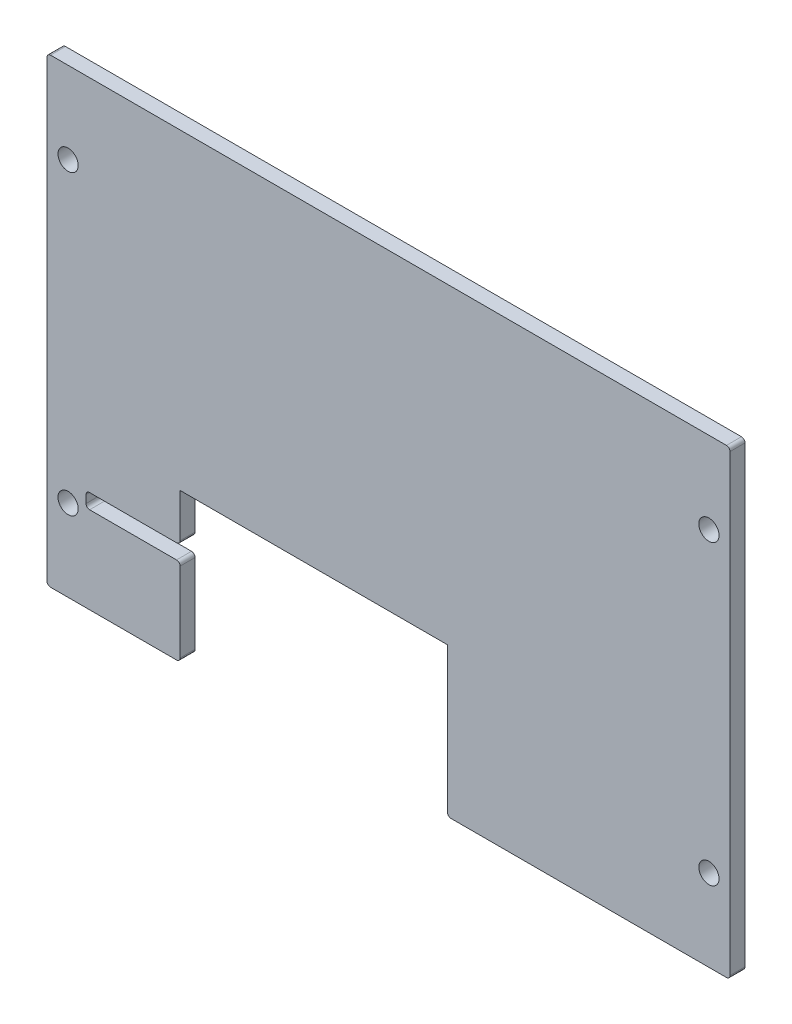
ISO-10303-21;
HEADER;
FILE_DESCRIPTION(('STEP AP214'),'2;1');
FILE_NAME('part.step','',(''),(''),'','','');
FILE_SCHEMA(('AUTOMOTIVE_DESIGN { 1 0 10303 214 1 1 1 1 }'));
ENDSEC;
DATA;
#1=APPLICATION_CONTEXT('core data for automotive mechanical design processes');
#2=APPLICATION_PROTOCOL_DEFINITION('international standard','automotive_design',2000,#1);
#3=PRODUCT_CONTEXT('',#1,'mechanical');
#4=PRODUCT('Part','Part','',(#3));
#5=PRODUCT_RELATED_PRODUCT_CATEGORY('part','',(#4));
#6=PRODUCT_DEFINITION_FORMATION('','',#4);
#7=PRODUCT_DEFINITION_CONTEXT('part definition',#1,'design');
#8=PRODUCT_DEFINITION('design','',#6,#7);
#9=PRODUCT_DEFINITION_SHAPE('','',#8);
#10=(LENGTH_UNIT() NAMED_UNIT(*) SI_UNIT(.MILLI.,.METRE.));
#11=(NAMED_UNIT(*) PLANE_ANGLE_UNIT() SI_UNIT($,.RADIAN.));
#12=(NAMED_UNIT(*) SI_UNIT($,.STERADIAN.) SOLID_ANGLE_UNIT());
#13=UNCERTAINTY_MEASURE_WITH_UNIT(LENGTH_MEASURE(1.E-05),#10,'distance_accuracy_value','');
#14=(GEOMETRIC_REPRESENTATION_CONTEXT(3) GLOBAL_UNCERTAINTY_ASSIGNED_CONTEXT((#13)) GLOBAL_UNIT_ASSIGNED_CONTEXT((#10,
#11,#12)) REPRESENTATION_CONTEXT('',''));
#15=CARTESIAN_POINT('',(0.,0.,0.));
#16=DIRECTION('',(0.,0.,1.));
#17=DIRECTION('',(1.,0.,0.));
#18=AXIS2_PLACEMENT_3D('',#15,#16,#17);
#19=CARTESIAN_POINT('',(28.43276,31.75,-65.3335481592298));
#20=DIRECTION('',(-1.,0.,0.));
#21=DIRECTION('',(0.,0.,1.));
#22=AXIS2_PLACEMENT_3D('',#19,#20,#21);
#23=PLANE('',#22);
#24=DIRECTION('',(0.,1.,0.));
#25=VECTOR('',#24,1.);
#26=CARTESIAN_POINT('',(28.43276,31.75,0.));
#27=LINE('',#26,#25);
#28=CARTESIAN_POINT('',(28.43276,0.761999999999999,0.));
#29=VERTEX_POINT('',#28);
#30=CARTESIAN_POINT('',(28.43276,17.74952,0.));
#31=VERTEX_POINT('',#30);
#32=EDGE_CURVE('E232',#29,#31,#27,.T.);
#33=ORIENTED_EDGE('',*,*,#32,.T.);
#34=DIRECTION('',(0.,0.,-1.));
#35=VECTOR('',#34,1.);
#36=CARTESIAN_POINT('',(28.43276,17.74952,-65.3335481592298));
#37=LINE('',#36,#35);
#38=CARTESIAN_POINT('',(28.43276,17.74952,3.2004));
#39=VERTEX_POINT('',#38);
#40=EDGE_CURVE('E273',#31,#39,#37,.F.);
#41=ORIENTED_EDGE('',*,*,#40,.T.);
#42=DIRECTION('',(0.,-1.,0.));
#43=VECTOR('',#42,1.);
#44=CARTESIAN_POINT('',(28.43276,31.75,3.2004));
#45=LINE('',#44,#43);
#46=CARTESIAN_POINT('',(28.43276,0.761999999999999,3.2004));
#47=VERTEX_POINT('',#46);
#48=EDGE_CURVE('E378',#39,#47,#45,.T.);
#49=ORIENTED_EDGE('',*,*,#48,.T.);
#50=DIRECTION('',(0.,0.,1.));
#51=VECTOR('',#50,1.);
#52=CARTESIAN_POINT('',(28.43276,0.761999999999999,-65.3335481592298));
#53=LINE('',#52,#51);
#54=EDGE_CURVE('E271',#47,#29,#53,.F.);
#55=ORIENTED_EDGE('',*,*,#54,.T.);
#56=EDGE_LOOP('',(#33,#41,#49,#55));
#57=FACE_BOUND('',#56,.T.);
#58=ADVANCED_FACE('F33',(#57),#23,.F.);
#59=CARTESIAN_POINT('',(0.,0.,3.2004));
#60=DIRECTION('',(0.,1.,0.));
#61=DIRECTION('',(0.,0.,1.));
#62=AXIS2_PLACEMENT_3D('',#59,#60,#61);
#63=PLANE('',#62);
#64=DIRECTION('',(1.,0.,0.));
#65=VECTOR('',#64,1.);
#66=CARTESIAN_POINT('',(0.,0.,0.));
#67=LINE('',#66,#65);
#68=CARTESIAN_POINT('',(0.762,0.,0.));
#69=VERTEX_POINT('',#68);
#70=CARTESIAN_POINT('',(27.67076,0.,0.));
#71=VERTEX_POINT('',#70);
#72=EDGE_CURVE('E235',#69,#71,#67,.T.);
#73=ORIENTED_EDGE('',*,*,#72,.T.);
#74=DIRECTION('',(0.,0.,1.));
#75=VECTOR('',#74,1.);
#76=CARTESIAN_POINT('',(27.67076,0.,3.2004));
#77=LINE('',#76,#75);
#78=CARTESIAN_POINT('',(27.67076,0.,3.2004));
#79=VERTEX_POINT('',#78);
#80=EDGE_CURVE('E305',#71,#79,#77,.T.);
#81=ORIENTED_EDGE('',*,*,#80,.T.);
#82=DIRECTION('',(1.,0.,0.));
#83=VECTOR('',#82,1.);
#84=CARTESIAN_POINT('',(0.,0.,3.2004));
#85=LINE('',#84,#83);
#86=CARTESIAN_POINT('',(0.762,0.,3.2004));
#87=VERTEX_POINT('',#86);
#88=EDGE_CURVE('E219',#87,#79,#85,.T.);
#89=ORIENTED_EDGE('',*,*,#88,.F.);
#90=DIRECTION('',(0.,0.,-1.));
#91=VECTOR('',#90,1.);
#92=CARTESIAN_POINT('',(0.762,0.,3.2004));
#93=LINE('',#92,#91);
#94=EDGE_CURVE('E302',#87,#69,#93,.T.);
#95=ORIENTED_EDGE('',*,*,#94,.T.);
#96=EDGE_LOOP('',(#73,#81,#89,#95));
#97=FACE_BOUND('',#96,.T.);
#98=ADVANCED_FACE('F395',(#97),#63,.F.);
#99=CARTESIAN_POINT('',(0.,98.425,3.2004));
#100=DIRECTION('',(1.,0.,0.));
#101=DIRECTION('',(0.,1.,0.));
#102=AXIS2_PLACEMENT_3D('',#99,#100,#101);
#103=PLANE('',#102);
#104=DIRECTION('',(0.,-1.,0.));
#105=VECTOR('',#104,1.);
#106=CARTESIAN_POINT('',(0.,98.425,0.));
#107=LINE('',#106,#105);
#108=CARTESIAN_POINT('',(0.,97.663,0.));
#109=VERTEX_POINT('',#108);
#110=CARTESIAN_POINT('',(0.,0.761999999999999,0.));
#111=VERTEX_POINT('',#110);
#112=EDGE_CURVE('E228',#109,#111,#107,.T.);
#113=ORIENTED_EDGE('',*,*,#112,.T.);
#114=DIRECTION('',(0.,0.,-1.));
#115=VECTOR('',#114,1.);
#116=CARTESIAN_POINT('',(0.,0.761999999999999,3.2004));
#117=LINE('',#116,#115);
#118=CARTESIAN_POINT('',(0.,0.761999999999999,3.2004));
#119=VERTEX_POINT('',#118);
#120=EDGE_CURVE('E310',#111,#119,#117,.F.);
#121=ORIENTED_EDGE('',*,*,#120,.T.);
#122=DIRECTION('',(0.,-1.,0.));
#123=VECTOR('',#122,1.);
#124=CARTESIAN_POINT('',(0.,98.425,3.2004));
#125=LINE('',#124,#123);
#126=CARTESIAN_POINT('',(0.,97.663,3.2004));
#127=VERTEX_POINT('',#126);
#128=EDGE_CURVE('E215',#127,#119,#125,.T.);
#129=ORIENTED_EDGE('',*,*,#128,.F.);
#130=DIRECTION('',(0.,0.,-1.));
#131=VECTOR('',#130,1.);
#132=CARTESIAN_POINT('',(0.,97.663,3.2004));
#133=LINE('',#132,#131);
#134=EDGE_CURVE('E307',#127,#109,#133,.T.);
#135=ORIENTED_EDGE('',*,*,#134,.T.);
#136=EDGE_LOOP('',(#113,#121,#129,#135));
#137=FACE_BOUND('',#136,.T.);
#138=ADVANCED_FACE('F402',(#137),#103,.F.);
#139=CARTESIAN_POINT('',(86.294760132,0.,0.));
#140=VERTEX_POINT('',#139);
#141=CARTESIAN_POINT('',(145.123353282042,0.,0.));
#142=VERTEX_POINT('',#141);
#143=EDGE_CURVE('E231',#140,#142,#67,.T.);
#144=ORIENTED_EDGE('',*,*,#143,.T.);
#145=DIRECTION('',(0.,0.,-1.));
#146=VECTOR('',#145,1.);
#147=CARTESIAN_POINT('',(145.123353282042,0.,3.2004));
#148=LINE('',#147,#146);
#149=CARTESIAN_POINT('',(145.123353282042,0.,3.2004));
#150=VERTEX_POINT('',#149);
#151=EDGE_CURVE('E299',#142,#150,#148,.F.);
#152=ORIENTED_EDGE('',*,*,#151,.T.);
#153=CARTESIAN_POINT('',(86.294760132,0.,3.2004));
#154=VERTEX_POINT('',#153);
#155=EDGE_CURVE('E217',#154,#150,#85,.T.);
#156=ORIENTED_EDGE('',*,*,#155,.F.);
#157=DIRECTION('',(0.,0.,1.));
#158=VECTOR('',#157,1.);
#159=CARTESIAN_POINT('',(86.294760132,0.,3.2004));
#160=LINE('',#159,#158);
#161=EDGE_CURVE('E297',#154,#140,#160,.F.);
#162=ORIENTED_EDGE('',*,*,#161,.T.);
#163=EDGE_LOOP('',(#144,#152,#156,#162));
#164=FACE_BOUND('',#163,.T.);
#165=ADVANCED_FACE('F429',(#164),#63,.F.);
#166=CARTESIAN_POINT('',(145.885353282042,98.425,3.2004));
#167=DIRECTION('',(-1.,0.,0.));
#168=DIRECTION('',(0.,0.,1.));
#169=AXIS2_PLACEMENT_3D('',#166,#167,#168);
#170=PLANE('',#169);
#171=DIRECTION('',(0.,1.,0.));
#172=VECTOR('',#171,1.);
#173=CARTESIAN_POINT('',(145.885353282042,98.425,3.2004));
#174=LINE('',#173,#172);
#175=CARTESIAN_POINT('',(145.885353282042,0.761999999999999,3.2004));
#176=VERTEX_POINT('',#175);
#177=CARTESIAN_POINT('',(145.885353282042,97.663,3.2004));
#178=VERTEX_POINT('',#177);
#179=EDGE_CURVE('E221',#176,#178,#174,.T.);
#180=ORIENTED_EDGE('',*,*,#179,.F.);
#181=DIRECTION('',(0.,0.,-1.));
#182=VECTOR('',#181,1.);
#183=CARTESIAN_POINT('',(145.885353282042,0.761999999999999,3.2004));
#184=LINE('',#183,#182);
#185=CARTESIAN_POINT('',(145.885353282042,0.761999999999999,0.));
#186=VERTEX_POINT('',#185);
#187=EDGE_CURVE('E294',#176,#186,#184,.T.);
#188=ORIENTED_EDGE('',*,*,#187,.T.);
#189=DIRECTION('',(0.,1.,0.));
#190=VECTOR('',#189,1.);
#191=CARTESIAN_POINT('',(145.885353282042,98.425,0.));
#192=LINE('',#191,#190);
#193=CARTESIAN_POINT('',(145.885353282042,97.663,0.));
#194=VERTEX_POINT('',#193);
#195=EDGE_CURVE('E236',#186,#194,#192,.T.);
#196=ORIENTED_EDGE('',*,*,#195,.T.);
#197=DIRECTION('',(0.,0.,-1.));
#198=VECTOR('',#197,1.);
#199=CARTESIAN_POINT('',(145.885353282042,97.663,3.2004));
#200=LINE('',#199,#198);
#201=EDGE_CURVE('E292',#194,#178,#200,.F.);
#202=ORIENTED_EDGE('',*,*,#201,.T.);
#203=EDGE_LOOP('',(#180,#188,#196,#202));
#204=FACE_BOUND('',#203,.T.);
#205=ADVANCED_FACE('F420',(#204),#170,.F.);
#206=CARTESIAN_POINT('',(0.,98.425,3.2004));
#207=DIRECTION('',(0.,-1.,0.));
#208=DIRECTION('',(0.,0.,-1.));
#209=AXIS2_PLACEMENT_3D('',#206,#207,#208);
#210=PLANE('',#209);
#211=DIRECTION('',(-1.,0.,0.));
#212=VECTOR('',#211,1.);
#213=CARTESIAN_POINT('',(0.,98.425,3.2004));
#214=LINE('',#213,#212);
#215=CARTESIAN_POINT('',(145.123353282042,98.425,3.2004));
#216=VERTEX_POINT('',#215);
#217=CARTESIAN_POINT('',(0.762,98.425,3.2004));
#218=VERTEX_POINT('',#217);
#219=EDGE_CURVE('E224',#216,#218,#214,.T.);
#220=ORIENTED_EDGE('',*,*,#219,.F.);
#221=DIRECTION('',(0.,0.,-1.));
#222=VECTOR('',#221,1.);
#223=CARTESIAN_POINT('',(145.123353282042,98.425,3.2004));
#224=LINE('',#223,#222);
#225=CARTESIAN_POINT('',(145.123353282042,98.425,0.));
#226=VERTEX_POINT('',#225);
#227=EDGE_CURVE('E314',#216,#226,#224,.T.);
#228=ORIENTED_EDGE('',*,*,#227,.T.);
#229=DIRECTION('',(-1.,0.,0.));
#230=VECTOR('',#229,1.);
#231=CARTESIAN_POINT('',(0.,98.425,0.));
#232=LINE('',#231,#230);
#233=CARTESIAN_POINT('',(0.762,98.425,0.));
#234=VERTEX_POINT('',#233);
#235=EDGE_CURVE('E218',#226,#234,#232,.T.);
#236=ORIENTED_EDGE('',*,*,#235,.T.);
#237=DIRECTION('',(0.,0.,-1.));
#238=VECTOR('',#237,1.);
#239=CARTESIAN_POINT('',(0.762,98.425,3.2004));
#240=LINE('',#239,#238);
#241=EDGE_CURVE('E312',#234,#218,#240,.F.);
#242=ORIENTED_EDGE('',*,*,#241,.T.);
#243=EDGE_LOOP('',(#220,#228,#236,#242));
#244=FACE_BOUND('',#243,.T.);
#245=ADVANCED_FACE('F411',(#244),#210,.F.);
#246=CARTESIAN_POINT('',(0.,0.,3.2004));
#247=DIRECTION('',(0.,0.,1.));
#248=DIRECTION('',(1.,0.,0.));
#249=AXIS2_PLACEMENT_3D('',#246,#247,#248);
#250=PLANE('',#249);
#251=ORIENTED_EDGE('',*,*,#48,.F.);
#252=CARTESIAN_POINT('',(27.67076,17.74952,3.2004));
#253=DIRECTION('',(0.,0.,1.));
#254=DIRECTION('',(1.,0.,0.));
#255=AXIS2_PLACEMENT_3D('',#252,#253,#254);
#256=CIRCLE('',#255,0.762);
#257=CARTESIAN_POINT('',(27.67076,18.51152,3.2004));
#258=VERTEX_POINT('',#257);
#259=EDGE_CURVE('E287',#39,#258,#256,.T.);
#260=ORIENTED_EDGE('',*,*,#259,.T.);
#261=DIRECTION('',(-1.,0.,0.));
#262=VECTOR('',#261,1.);
#263=CARTESIAN_POINT('',(28.43276,18.51152,3.2004));
#264=LINE('',#263,#262);
#265=CARTESIAN_POINT('',(9.1019099778454,18.51152,3.2004));
#266=VERTEX_POINT('',#265);
#267=EDGE_CURVE('E343',#258,#266,#264,.T.);
#268=ORIENTED_EDGE('',*,*,#267,.T.);
#269=CARTESIAN_POINT('',(9.10190997784539,19.27352,3.2004));
#270=DIRECTION('',(0.,0.,1.));
#271=DIRECTION('',(1.,0.,0.));
#272=AXIS2_PLACEMENT_3D('',#269,#270,#271);
#273=CIRCLE('',#272,0.762);
#274=CARTESIAN_POINT('',(8.33990997784539,19.27352,3.2004));
#275=VERTEX_POINT('',#274);
#276=EDGE_CURVE('E11',#266,#275,#273,.F.);
#277=ORIENTED_EDGE('',*,*,#276,.T.);
#278=DIRECTION('',(0.,1.,0.));
#279=VECTOR('',#278,1.);
#280=CARTESIAN_POINT('',(8.33990997784539,18.51152,3.2004));
#281=LINE('',#280,#279);
#282=CARTESIAN_POINT('',(8.33990997784539,20.92452,3.2004));
#283=VERTEX_POINT('',#282);
#284=EDGE_CURVE('E341',#275,#283,#281,.T.);
#285=ORIENTED_EDGE('',*,*,#284,.T.);
#286=CARTESIAN_POINT('',(9.1019099778454,20.92452,3.2004));
#287=DIRECTION('',(0.,0.,1.));
#288=DIRECTION('',(1.,0.,0.));
#289=AXIS2_PLACEMENT_3D('',#286,#287,#288);
#290=CIRCLE('',#289,0.762);
#291=CARTESIAN_POINT('',(9.1019099778454,21.68652,3.2004));
#292=VERTEX_POINT('',#291);
#293=EDGE_CURVE('E319',#283,#292,#290,.F.);
#294=ORIENTED_EDGE('',*,*,#293,.T.);
#295=DIRECTION('',(1.,0.,0.));
#296=VECTOR('',#295,1.);
#297=CARTESIAN_POINT('',(28.43276,21.68652,3.2004));
#298=LINE('',#297,#296);
#299=CARTESIAN_POINT('',(27.67076,21.68652,3.2004));
#300=VERTEX_POINT('',#299);
#301=EDGE_CURVE('E347',#292,#300,#298,.T.);
#302=ORIENTED_EDGE('',*,*,#301,.T.);
#303=CARTESIAN_POINT('',(27.67076,22.44852,3.20040000000001));
#304=DIRECTION('',(0.,0.,1.));
#305=DIRECTION('',(1.,0.,0.));
#306=AXIS2_PLACEMENT_3D('',#303,#304,#305);
#307=CIRCLE('',#306,0.762);
#308=CARTESIAN_POINT('',(28.43276,22.44852,3.2004));
#309=VERTEX_POINT('',#308);
#310=EDGE_CURVE('E285',#300,#309,#307,.T.);
#311=ORIENTED_EDGE('',*,*,#310,.T.);
#312=CARTESIAN_POINT('',(28.43276,31.75,3.2004));
#313=VERTEX_POINT('',#312);
#314=EDGE_CURVE('E194',#313,#309,#45,.T.);
#315=ORIENTED_EDGE('',*,*,#314,.F.);
#316=DIRECTION('',(-1.,0.,0.));
#317=VECTOR('',#316,1.);
#318=CARTESIAN_POINT('',(28.43276,31.75,3.2004));
#319=LINE('',#318,#317);
#320=CARTESIAN_POINT('',(85.532760132,31.75,3.2004));
#321=VERTEX_POINT('',#320);
#322=EDGE_CURVE('E193',#321,#313,#319,.T.);
#323=ORIENTED_EDGE('',*,*,#322,.F.);
#324=DIRECTION('',(0.,1.,0.));
#325=VECTOR('',#324,1.);
#326=CARTESIAN_POINT('',(85.532760132,31.75,3.2004));
#327=LINE('',#326,#325);
#328=CARTESIAN_POINT('',(85.532760132,0.761999999999999,3.2004));
#329=VERTEX_POINT('',#328);
#330=EDGE_CURVE('E184',#329,#321,#327,.T.);
#331=ORIENTED_EDGE('',*,*,#330,.F.);
#332=CARTESIAN_POINT('',(86.294760132,0.761999999999999,3.20040000000001));
#333=DIRECTION('',(0.,0.,1.));
#334=DIRECTION('',(1.,0.,0.));
#335=AXIS2_PLACEMENT_3D('',#332,#333,#334);
#336=CIRCLE('',#335,0.762);
#337=EDGE_CURVE('E281',#329,#154,#336,.T.);
#338=ORIENTED_EDGE('',*,*,#337,.T.);
#339=ORIENTED_EDGE('',*,*,#155,.T.);
#340=CARTESIAN_POINT('',(145.123353282042,0.761999999999999,3.2004));
#341=DIRECTION('',(0.,0.,1.));
#342=DIRECTION('',(1.,0.,0.));
#343=AXIS2_PLACEMENT_3D('',#340,#341,#342);
#344=CIRCLE('',#343,0.762);
#345=EDGE_CURVE('E283',#150,#176,#344,.T.);
#346=ORIENTED_EDGE('',*,*,#345,.T.);
#347=ORIENTED_EDGE('',*,*,#179,.T.);
#348=CARTESIAN_POINT('',(145.123353282042,97.663,3.2004));
#349=DIRECTION('',(0.,0.,1.));
#350=DIRECTION('',(1.,0.,0.));
#351=AXIS2_PLACEMENT_3D('',#348,#349,#350);
#352=CIRCLE('',#351,0.762);
#353=EDGE_CURVE('E277',#178,#216,#352,.T.);
#354=ORIENTED_EDGE('',*,*,#353,.T.);
#355=ORIENTED_EDGE('',*,*,#219,.T.);
#356=CARTESIAN_POINT('',(0.762,97.663,3.2004));
#357=DIRECTION('',(0.,0.,1.));
#358=DIRECTION('',(1.,0.,0.));
#359=AXIS2_PLACEMENT_3D('',#356,#357,#358);
#360=CIRCLE('',#359,0.762);
#361=EDGE_CURVE('E275',#218,#127,#360,.T.);
#362=ORIENTED_EDGE('',*,*,#361,.T.);
#363=ORIENTED_EDGE('',*,*,#128,.T.);
#364=CARTESIAN_POINT('',(0.762,0.762,3.2004));
#365=DIRECTION('',(0.,0.,1.));
#366=DIRECTION('',(1.,0.,0.));
#367=AXIS2_PLACEMENT_3D('',#364,#365,#366);
#368=CIRCLE('',#367,0.762);
#369=EDGE_CURVE('E56',#119,#87,#368,.T.);
#370=ORIENTED_EDGE('',*,*,#369,.T.);
#371=ORIENTED_EDGE('',*,*,#88,.T.);
#372=CARTESIAN_POINT('',(27.67076,0.762,3.2004));
#373=DIRECTION('',(0.,0.,1.));
#374=DIRECTION('',(1.,0.,0.));
#375=AXIS2_PLACEMENT_3D('',#372,#373,#374);
#376=CIRCLE('',#375,0.762);
#377=EDGE_CURVE('E48',#79,#47,#376,.T.);
#378=ORIENTED_EDGE('',*,*,#377,.T.);
#379=EDGE_LOOP('',(#251,#260,#268,#277,#285,#294,#302,#311,#315,#323,#331,#338,#339,#346,#347,
#354,#355,#362,#363,#370,#371,#378));
#380=FACE_BOUND('',#379,.T.);
#381=CARTESIAN_POINT('',(4.5085,80.9625,3.2004));
#382=DIRECTION('',(0.,0.,1.));
#383=DIRECTION('',(1.,0.,0.));
#384=AXIS2_PLACEMENT_3D('',#381,#382,#383);
#385=CIRCLE('',#384,2.159);
#386=CARTESIAN_POINT('',(6.6675,80.9625,3.2004));
#387=VERTEX_POINT('',#386);
#388=EDGE_CURVE('E350',#387,#387,#385,.T.);
#389=ORIENTED_EDGE('',*,*,#388,.F.);
#390=EDGE_LOOP('',(#389));
#391=FACE_BOUND('',#390,.T.);
#392=CARTESIAN_POINT('',(4.50850000000002,17.4625,3.2004));
#393=DIRECTION('',(0.,0.,1.));
#394=DIRECTION('',(1.,0.,0.));
#395=AXIS2_PLACEMENT_3D('',#392,#393,#394);
#396=CIRCLE('',#395,2.159);
#397=CARTESIAN_POINT('',(6.66750000000002,17.4625,3.2004));
#398=VERTEX_POINT('',#397);
#399=EDGE_CURVE('E363',#398,#398,#396,.T.);
#400=ORIENTED_EDGE('',*,*,#399,.F.);
#401=EDGE_LOOP('',(#400));
#402=FACE_BOUND('',#401,.T.);
#403=CARTESIAN_POINT('',(141.376853282042,17.4625,3.2004));
#404=DIRECTION('',(0.,0.,1.));
#405=DIRECTION('',(1.,0.,0.));
#406=AXIS2_PLACEMENT_3D('',#403,#404,#405);
#407=CIRCLE('',#406,2.15899999999999);
#408=CARTESIAN_POINT('',(143.535853282042,17.4625,3.2004));
#409=VERTEX_POINT('',#408);
#410=EDGE_CURVE('E355',#409,#409,#407,.T.);
#411=ORIENTED_EDGE('',*,*,#410,.F.);
#412=EDGE_LOOP('',(#411));
#413=FACE_BOUND('',#412,.T.);
#414=CARTESIAN_POINT('',(141.376853282042,80.9625,3.2004));
#415=DIRECTION('',(0.,0.,1.));
#416=DIRECTION('',(1.,0.,0.));
#417=AXIS2_PLACEMENT_3D('',#414,#415,#416);
#418=CIRCLE('',#417,2.15899999999999);
#419=CARTESIAN_POINT('',(143.535853282042,80.9625,3.2004));
#420=VERTEX_POINT('',#419);
#421=EDGE_CURVE('E362',#420,#420,#418,.T.);
#422=ORIENTED_EDGE('',*,*,#421,.F.);
#423=EDGE_LOOP('',(#422));
#424=FACE_BOUND('',#423,.T.);
#425=ADVANCED_FACE('F207',(#380,#391,#402,#413,#424),#250,.T.);
#426=CARTESIAN_POINT('',(0.,0.,0.));
#427=DIRECTION('',(0.,0.,1.));
#428=DIRECTION('',(1.,0.,0.));
#429=AXIS2_PLACEMENT_3D('',#426,#427,#428);
#430=PLANE('',#429);
#431=CARTESIAN_POINT('',(4.5085,80.9625,0.));
#432=DIRECTION('',(0.,0.,1.));
#433=DIRECTION('',(1.,0.,0.));
#434=AXIS2_PLACEMENT_3D('',#431,#432,#433);
#435=CIRCLE('',#434,2.159);
#436=CARTESIAN_POINT('',(6.6675,80.9625,0.));
#437=VERTEX_POINT('',#436);
#438=EDGE_CURVE('E366',#437,#437,#435,.F.);
#439=ORIENTED_EDGE('',*,*,#438,.F.);
#440=EDGE_LOOP('',(#439));
#441=FACE_BOUND('',#440,.T.);
#442=CARTESIAN_POINT('',(4.50850000000002,17.4625,0.));
#443=DIRECTION('',(0.,0.,1.));
#444=DIRECTION('',(1.,0.,0.));
#445=AXIS2_PLACEMENT_3D('',#442,#443,#444);
#446=CIRCLE('',#445,2.159);
#447=CARTESIAN_POINT('',(6.66750000000002,17.4625,0.));
#448=VERTEX_POINT('',#447);
#449=EDGE_CURVE('E359',#448,#448,#446,.F.);
#450=ORIENTED_EDGE('',*,*,#449,.F.);
#451=EDGE_LOOP('',(#450));
#452=FACE_BOUND('',#451,.T.);
#453=CARTESIAN_POINT('',(141.376853282042,17.4625,0.));
#454=DIRECTION('',(0.,0.,1.));
#455=DIRECTION('',(1.,0.,0.));
#456=AXIS2_PLACEMENT_3D('',#453,#454,#455);
#457=CIRCLE('',#456,2.15899999999999);
#458=CARTESIAN_POINT('',(143.535853282042,17.4625,0.));
#459=VERTEX_POINT('',#458);
#460=EDGE_CURVE('E358',#459,#459,#457,.F.);
#461=ORIENTED_EDGE('',*,*,#460,.F.);
#462=EDGE_LOOP('',(#461));
#463=FACE_BOUND('',#462,.T.);
#464=CARTESIAN_POINT('',(141.376853282042,80.9625,0.));
#465=DIRECTION('',(0.,0.,1.));
#466=DIRECTION('',(1.,0.,0.));
#467=AXIS2_PLACEMENT_3D('',#464,#465,#466);
#468=CIRCLE('',#467,2.15899999999999);
#469=CARTESIAN_POINT('',(143.535853282042,80.9625,0.));
#470=VERTEX_POINT('',#469);
#471=EDGE_CURVE('E375',#470,#470,#468,.F.);
#472=ORIENTED_EDGE('',*,*,#471,.F.);
#473=EDGE_LOOP('',(#472));
#474=FACE_BOUND('',#473,.T.);
#475=DIRECTION('',(-1.,0.,0.));
#476=VECTOR('',#475,1.);
#477=CARTESIAN_POINT('',(28.43276,18.51152,0.));
#478=LINE('',#477,#476);
#479=CARTESIAN_POINT('',(27.67076,18.51152,0.));
#480=VERTEX_POINT('',#479);
#481=CARTESIAN_POINT('',(9.1019099778454,18.51152,0.));
#482=VERTEX_POINT('',#481);
#483=EDGE_CURVE('E325',#480,#482,#478,.T.);
#484=ORIENTED_EDGE('',*,*,#483,.F.);
#485=CARTESIAN_POINT('',(27.67076,17.74952,0.));
#486=DIRECTION('',(0.,0.,1.));
#487=DIRECTION('',(1.,0.,0.));
#488=AXIS2_PLACEMENT_3D('',#485,#486,#487);
#489=CIRCLE('',#488,0.762);
#490=EDGE_CURVE('E269',#480,#31,#489,.F.);
#491=ORIENTED_EDGE('',*,*,#490,.T.);
#492=ORIENTED_EDGE('',*,*,#32,.F.);
#493=CARTESIAN_POINT('',(27.67076,0.762,0.));
#494=DIRECTION('',(0.,0.,1.));
#495=DIRECTION('',(1.,0.,0.));
#496=AXIS2_PLACEMENT_3D('',#493,#494,#495);
#497=CIRCLE('',#496,0.762);
#498=EDGE_CURVE('E261',#29,#71,#497,.F.);
#499=ORIENTED_EDGE('',*,*,#498,.T.);
#500=ORIENTED_EDGE('',*,*,#72,.F.);
#501=CARTESIAN_POINT('',(0.762,0.762,0.));
#502=DIRECTION('',(0.,0.,1.));
#503=DIRECTION('',(1.,0.,0.));
#504=AXIS2_PLACEMENT_3D('',#501,#502,#503);
#505=CIRCLE('',#504,0.762);
#506=EDGE_CURVE('E259',#69,#111,#505,.F.);
#507=ORIENTED_EDGE('',*,*,#506,.T.);
#508=ORIENTED_EDGE('',*,*,#112,.F.);
#509=CARTESIAN_POINT('',(0.762,97.663,0.));
#510=DIRECTION('',(0.,0.,1.));
#511=DIRECTION('',(1.,0.,0.));
#512=AXIS2_PLACEMENT_3D('',#509,#510,#511);
#513=CIRCLE('',#512,0.762);
#514=EDGE_CURVE('E255',#109,#234,#513,.F.);
#515=ORIENTED_EDGE('',*,*,#514,.T.);
#516=ORIENTED_EDGE('',*,*,#235,.F.);
#517=CARTESIAN_POINT('',(145.123353282042,97.663,0.));
#518=DIRECTION('',(0.,0.,1.));
#519=DIRECTION('',(1.,0.,0.));
#520=AXIS2_PLACEMENT_3D('',#517,#518,#519);
#521=CIRCLE('',#520,0.762);
#522=EDGE_CURVE('E257',#226,#194,#521,.F.);
#523=ORIENTED_EDGE('',*,*,#522,.T.);
#524=ORIENTED_EDGE('',*,*,#195,.F.);
#525=CARTESIAN_POINT('',(145.123353282042,0.761999999999999,0.));
#526=DIRECTION('',(0.,0.,1.));
#527=DIRECTION('',(1.,0.,0.));
#528=AXIS2_PLACEMENT_3D('',#525,#526,#527);
#529=CIRCLE('',#528,0.762);
#530=EDGE_CURVE('E265',#186,#142,#529,.F.);
#531=ORIENTED_EDGE('',*,*,#530,.T.);
#532=ORIENTED_EDGE('',*,*,#143,.F.);
#533=CARTESIAN_POINT('',(86.294760132,0.761999999999999,0.));
#534=DIRECTION('',(0.,0.,1.));
#535=DIRECTION('',(1.,0.,0.));
#536=AXIS2_PLACEMENT_3D('',#533,#534,#535);
#537=CIRCLE('',#536,0.762);
#538=CARTESIAN_POINT('',(85.532760132,0.761999999999999,0.));
#539=VERTEX_POINT('',#538);
#540=EDGE_CURVE('E263',#140,#539,#537,.F.);
#541=ORIENTED_EDGE('',*,*,#540,.T.);
#542=DIRECTION('',(0.,-1.,0.));
#543=VECTOR('',#542,1.);
#544=CARTESIAN_POINT('',(85.532760132,31.75,0.));
#545=LINE('',#544,#543);
#546=CARTESIAN_POINT('',(85.532760132,31.75,0.));
#547=VERTEX_POINT('',#546);
#548=EDGE_CURVE('E213',#547,#539,#545,.T.);
#549=ORIENTED_EDGE('',*,*,#548,.F.);
#550=DIRECTION('',(1.,0.,0.));
#551=VECTOR('',#550,1.);
#552=CARTESIAN_POINT('',(28.43276,31.75,0.));
#553=LINE('',#552,#551);
#554=CARTESIAN_POINT('',(28.43276,31.75,0.));
#555=VERTEX_POINT('',#554);
#556=EDGE_CURVE('E202',#555,#547,#553,.T.);
#557=ORIENTED_EDGE('',*,*,#556,.F.);
#558=CARTESIAN_POINT('',(28.43276,22.44852,0.));
#559=VERTEX_POINT('',#558);
#560=EDGE_CURVE('E381',#559,#555,#27,.T.);
#561=ORIENTED_EDGE('',*,*,#560,.F.);
#562=CARTESIAN_POINT('',(27.67076,22.44852,0.));
#563=DIRECTION('',(0.,0.,1.));
#564=DIRECTION('',(1.,0.,0.));
#565=AXIS2_PLACEMENT_3D('',#562,#563,#564);
#566=CIRCLE('',#565,0.762);
#567=CARTESIAN_POINT('',(27.67076,21.68652,0.));
#568=VERTEX_POINT('',#567);
#569=EDGE_CURVE('E267',#559,#568,#566,.F.);
#570=ORIENTED_EDGE('',*,*,#569,.T.);
#571=DIRECTION('',(1.,0.,0.));
#572=VECTOR('',#571,1.);
#573=CARTESIAN_POINT('',(28.43276,21.68652,0.));
#574=LINE('',#573,#572);
#575=CARTESIAN_POINT('',(9.1019099778454,21.68652,0.));
#576=VERTEX_POINT('',#575);
#577=EDGE_CURVE('E352',#576,#568,#574,.T.);
#578=ORIENTED_EDGE('',*,*,#577,.F.);
#579=CARTESIAN_POINT('',(9.1019099778454,20.92452,0.));
#580=DIRECTION('',(0.,0.,1.));
#581=DIRECTION('',(1.,0.,0.));
#582=AXIS2_PLACEMENT_3D('',#579,#580,#581);
#583=CIRCLE('',#582,0.762);
#584=CARTESIAN_POINT('',(8.33990997784539,20.92452,0.));
#585=VERTEX_POINT('',#584);
#586=EDGE_CURVE('E317',#576,#585,#583,.T.);
#587=ORIENTED_EDGE('',*,*,#586,.T.);
#588=DIRECTION('',(0.,1.,0.));
#589=VECTOR('',#588,1.);
#590=CARTESIAN_POINT('',(8.33990997784539,18.51152,0.));
#591=LINE('',#590,#589);
#592=CARTESIAN_POINT('',(8.33990997784539,19.27352,0.));
#593=VERTEX_POINT('',#592);
#594=EDGE_CURVE('E327',#593,#585,#591,.T.);
#595=ORIENTED_EDGE('',*,*,#594,.F.);
#596=CARTESIAN_POINT('',(9.10190997784539,19.27352,0.));
#597=DIRECTION('',(0.,0.,1.));
#598=DIRECTION('',(1.,0.,0.));
#599=AXIS2_PLACEMENT_3D('',#596,#597,#598);
#600=CIRCLE('',#599,0.762);
#601=EDGE_CURVE('E41',#593,#482,#600,.T.);
#602=ORIENTED_EDGE('',*,*,#601,.T.);
#603=EDGE_LOOP('',(#484,#491,#492,#499,#500,#507,#508,#515,#516,#523,#524,#531,#532,#541,#549,
#557,#561,#570,#578,#587,#595,#602));
#604=FACE_BOUND('',#603,.T.);
#605=ADVANCED_FACE('F324',(#441,#452,#463,#474,#604),#430,.F.);
#606=ORIENTED_EDGE('',*,*,#314,.T.);
#607=DIRECTION('',(0.,0.,-1.));
#608=VECTOR('',#607,1.);
#609=CARTESIAN_POINT('',(28.43276,22.44852,-65.3335481592298));
#610=LINE('',#609,#608);
#611=EDGE_CURVE('E289',#309,#559,#610,.T.);
#612=ORIENTED_EDGE('',*,*,#611,.T.);
#613=ORIENTED_EDGE('',*,*,#560,.T.);
#614=DIRECTION('',(0.,0.,1.));
#615=VECTOR('',#614,1.);
#616=CARTESIAN_POINT('',(28.43276,31.75,-65.3335481592298));
#617=LINE('',#616,#615);
#618=EDGE_CURVE('E204',#555,#313,#617,.T.);
#619=ORIENTED_EDGE('',*,*,#618,.T.);
#620=EDGE_LOOP('',(#606,#612,#613,#619));
#621=FACE_BOUND('',#620,.T.);
#622=ADVANCED_FACE('F438',(#621),#23,.F.);
#623=CARTESIAN_POINT('',(28.43276,31.75,-65.3335481592298));
#624=DIRECTION('',(0.,1.,0.));
#625=DIRECTION('',(0.,0.,1.));
#626=AXIS2_PLACEMENT_3D('',#623,#624,#625);
#627=PLANE('',#626);
#628=ORIENTED_EDGE('',*,*,#556,.T.);
#629=DIRECTION('',(0.,0.,1.));
#630=VECTOR('',#629,1.);
#631=CARTESIAN_POINT('',(85.532760132,31.75,-65.3335481592298));
#632=LINE('',#631,#630);
#633=EDGE_CURVE('E188',#547,#321,#632,.T.);
#634=ORIENTED_EDGE('',*,*,#633,.T.);
#635=ORIENTED_EDGE('',*,*,#322,.T.);
#636=ORIENTED_EDGE('',*,*,#618,.F.);
#637=EDGE_LOOP('',(#628,#634,#635,#636));
#638=FACE_BOUND('',#637,.T.);
#639=ADVANCED_FACE('F198',(#638),#627,.F.);
#640=CARTESIAN_POINT('',(85.532760132,31.75,-65.3335481592298));
#641=DIRECTION('',(1.,0.,0.));
#642=DIRECTION('',(0.,1.,0.));
#643=AXIS2_PLACEMENT_3D('',#640,#641,#642);
#644=PLANE('',#643);
#645=ORIENTED_EDGE('',*,*,#548,.T.);
#646=DIRECTION('',(0.,0.,1.));
#647=VECTOR('',#646,1.);
#648=CARTESIAN_POINT('',(85.532760132,0.761999999999999,-65.3335481592298));
#649=LINE('',#648,#647);
#650=EDGE_CURVE('E191',#539,#329,#649,.T.);
#651=ORIENTED_EDGE('',*,*,#650,.T.);
#652=ORIENTED_EDGE('',*,*,#330,.T.);
#653=ORIENTED_EDGE('',*,*,#633,.F.);
#654=EDGE_LOOP('',(#645,#651,#652,#653));
#655=FACE_BOUND('',#654,.T.);
#656=ADVANCED_FACE('F187',(#655),#644,.F.);
#657=CARTESIAN_POINT('',(141.376853282042,80.9625,-6.10657416232704));
#658=DIRECTION('',(0.,0.,1.));
#659=DIRECTION('',(1.,0.,0.));
#660=AXIS2_PLACEMENT_3D('',#657,#658,#659);
#661=CYLINDRICAL_SURFACE('',#660,2.15899999999999);
#662=ORIENTED_EDGE('',*,*,#471,.T.);
#663=EDGE_LOOP('',(#662));
#664=FACE_BOUND('',#663,.T.);
#665=ORIENTED_EDGE('',*,*,#421,.T.);
#666=EDGE_LOOP('',(#665));
#667=FACE_BOUND('',#666,.T.);
#668=ADVANCED_FACE('F527',(#664,#667),#661,.F.);
#669=CARTESIAN_POINT('',(141.376853282042,17.4625,-6.10657416232704));
#670=DIRECTION('',(0.,0.,1.));
#671=DIRECTION('',(1.,0.,0.));
#672=AXIS2_PLACEMENT_3D('',#669,#670,#671);
#673=CYLINDRICAL_SURFACE('',#672,2.15899999999999);
#674=ORIENTED_EDGE('',*,*,#460,.T.);
#675=EDGE_LOOP('',(#674));
#676=FACE_BOUND('',#675,.T.);
#677=ORIENTED_EDGE('',*,*,#410,.T.);
#678=EDGE_LOOP('',(#677));
#679=FACE_BOUND('',#678,.T.);
#680=ADVANCED_FACE('F631',(#676,#679),#673,.F.);
#681=CARTESIAN_POINT('',(4.50850000000002,17.4625,-6.10657416232704));
#682=DIRECTION('',(0.,0.,1.));
#683=DIRECTION('',(1.,0.,0.));
#684=AXIS2_PLACEMENT_3D('',#681,#682,#683);
#685=CYLINDRICAL_SURFACE('',#684,2.159);
#686=ORIENTED_EDGE('',*,*,#449,.T.);
#687=EDGE_LOOP('',(#686));
#688=FACE_BOUND('',#687,.T.);
#689=ORIENTED_EDGE('',*,*,#399,.T.);
#690=EDGE_LOOP('',(#689));
#691=FACE_BOUND('',#690,.T.);
#692=ADVANCED_FACE('F634',(#688,#691),#685,.F.);
#693=CARTESIAN_POINT('',(4.5085,80.9625,-6.10657416232704));
#694=DIRECTION('',(0.,0.,1.));
#695=DIRECTION('',(1.,0.,0.));
#696=AXIS2_PLACEMENT_3D('',#693,#694,#695);
#697=CYLINDRICAL_SURFACE('',#696,2.159);
#698=ORIENTED_EDGE('',*,*,#438,.T.);
#699=EDGE_LOOP('',(#698));
#700=FACE_BOUND('',#699,.T.);
#701=ORIENTED_EDGE('',*,*,#388,.T.);
#702=EDGE_LOOP('',(#701));
#703=FACE_BOUND('',#702,.T.);
#704=ADVANCED_FACE('F537',(#700,#703),#697,.F.);
#705=CARTESIAN_POINT('',(28.43276,18.51152,23.542554433904));
#706=DIRECTION('',(0.,-1.,0.));
#707=DIRECTION('',(1.,0.,0.));
#708=AXIS2_PLACEMENT_3D('',#705,#706,#707);
#709=PLANE('',#708);
#710=ORIENTED_EDGE('',*,*,#483,.T.);
#711=DIRECTION('',(0.,0.,-1.));
#712=VECTOR('',#711,1.);
#713=CARTESIAN_POINT('',(9.10190997784539,18.51152,3.2004));
#714=LINE('',#713,#712);
#715=EDGE_CURVE('E253',#482,#266,#714,.F.);
#716=ORIENTED_EDGE('',*,*,#715,.T.);
#717=ORIENTED_EDGE('',*,*,#267,.F.);
#718=DIRECTION('',(0.,0.,-1.));
#719=VECTOR('',#718,1.);
#720=CARTESIAN_POINT('',(27.67076,18.51152,23.542554433904));
#721=LINE('',#720,#719);
#722=EDGE_CURVE('E250',#258,#480,#721,.T.);
#723=ORIENTED_EDGE('',*,*,#722,.T.);
#724=EDGE_LOOP('',(#710,#716,#717,#723));
#725=FACE_BOUND('',#724,.T.);
#726=ADVANCED_FACE('F332',(#725),#709,.F.);
#727=CARTESIAN_POINT('',(8.33990997784539,18.51152,23.542554433904));
#728=DIRECTION('',(-1.,0.,0.));
#729=DIRECTION('',(0.,0.,1.));
#730=AXIS2_PLACEMENT_3D('',#727,#728,#729);
#731=PLANE('',#730);
#732=ORIENTED_EDGE('',*,*,#594,.T.);
#733=DIRECTION('',(0.,0.,-1.));
#734=VECTOR('',#733,1.);
#735=CARTESIAN_POINT('',(8.33990997784539,20.92452,3.2004));
#736=LINE('',#735,#734);
#737=EDGE_CURVE('E248',#585,#283,#736,.F.);
#738=ORIENTED_EDGE('',*,*,#737,.T.);
#739=ORIENTED_EDGE('',*,*,#284,.F.);
#740=DIRECTION('',(0.,0.,-1.));
#741=VECTOR('',#740,1.);
#742=CARTESIAN_POINT('',(8.33990997784539,19.27352,0.));
#743=LINE('',#742,#741);
#744=EDGE_CURVE('E245',#275,#593,#743,.T.);
#745=ORIENTED_EDGE('',*,*,#744,.T.);
#746=EDGE_LOOP('',(#732,#738,#739,#745));
#747=FACE_BOUND('',#746,.T.);
#748=ADVANCED_FACE('F345',(#747),#731,.F.);
#749=CARTESIAN_POINT('',(28.43276,21.68652,23.542554433904));
#750=DIRECTION('',(0.,1.,0.));
#751=DIRECTION('',(-1.,0.,0.));
#752=AXIS2_PLACEMENT_3D('',#749,#750,#751);
#753=PLANE('',#752);
#754=ORIENTED_EDGE('',*,*,#301,.F.);
#755=DIRECTION('',(0.,0.,-1.));
#756=VECTOR('',#755,1.);
#757=CARTESIAN_POINT('',(9.1019099778454,21.68652,0.));
#758=LINE('',#757,#756);
#759=EDGE_CURVE('E242',#292,#576,#758,.T.);
#760=ORIENTED_EDGE('',*,*,#759,.T.);
#761=ORIENTED_EDGE('',*,*,#577,.T.);
#762=DIRECTION('',(0.,0.,-1.));
#763=VECTOR('',#762,1.);
#764=CARTESIAN_POINT('',(27.67076,21.68652,23.542554433904));
#765=LINE('',#764,#763);
#766=EDGE_CURVE('E227',#568,#300,#765,.F.);
#767=ORIENTED_EDGE('',*,*,#766,.T.);
#768=EDGE_LOOP('',(#754,#760,#761,#767));
#769=FACE_BOUND('',#768,.T.);
#770=ADVANCED_FACE('F445',(#769),#753,.F.);
#771=CARTESIAN_POINT('',(9.1019099778454,20.92452,23.542554433904));
#772=DIRECTION('',(0.,0.,1.));
#773=DIRECTION('',(1.,0.,0.));
#774=AXIS2_PLACEMENT_3D('',#771,#772,#773);
#775=CYLINDRICAL_SURFACE('',#774,0.762);
#776=ORIENTED_EDGE('',*,*,#293,.F.);
#777=ORIENTED_EDGE('',*,*,#737,.F.);
#778=ORIENTED_EDGE('',*,*,#586,.F.);
#779=ORIENTED_EDGE('',*,*,#759,.F.);
#780=EDGE_LOOP('',(#776,#777,#778,#779));
#781=FACE_BOUND('',#780,.T.);
#782=ADVANCED_FACE('F448',(#781),#775,.F.);
#783=CARTESIAN_POINT('',(9.10190997784539,19.27352,23.542554433904));
#784=DIRECTION('',(0.,0.,1.));
#785=DIRECTION('',(1.,0.,0.));
#786=AXIS2_PLACEMENT_3D('',#783,#784,#785);
#787=CYLINDRICAL_SURFACE('',#786,0.762);
#788=ORIENTED_EDGE('',*,*,#276,.F.);
#789=ORIENTED_EDGE('',*,*,#715,.F.);
#790=ORIENTED_EDGE('',*,*,#601,.F.);
#791=ORIENTED_EDGE('',*,*,#744,.F.);
#792=EDGE_LOOP('',(#788,#789,#790,#791));
#793=FACE_BOUND('',#792,.T.);
#794=ADVANCED_FACE('F338',(#793),#787,.F.);
#795=CARTESIAN_POINT('',(27.67076,17.74952,23.542554433904));
#796=DIRECTION('',(0.,0.,-1.));
#797=DIRECTION('',(-1.,0.,0.));
#798=AXIS2_PLACEMENT_3D('',#795,#796,#797);
#799=CYLINDRICAL_SURFACE('',#798,0.762);
#800=ORIENTED_EDGE('',*,*,#259,.F.);
#801=ORIENTED_EDGE('',*,*,#40,.F.);
#802=ORIENTED_EDGE('',*,*,#490,.F.);
#803=ORIENTED_EDGE('',*,*,#722,.F.);
#804=EDGE_LOOP('',(#800,#801,#802,#803));
#805=FACE_BOUND('',#804,.T.);
#806=ADVANCED_FACE('F457',(#805),#799,.T.);
#807=CARTESIAN_POINT('',(27.67076,22.44852,-65.3335481592298));
#808=DIRECTION('',(0.,0.,-1.));
#809=DIRECTION('',(-1.,0.,0.));
#810=AXIS2_PLACEMENT_3D('',#807,#808,#809);
#811=CYLINDRICAL_SURFACE('',#810,0.762);
#812=ORIENTED_EDGE('',*,*,#310,.F.);
#813=ORIENTED_EDGE('',*,*,#766,.F.);
#814=ORIENTED_EDGE('',*,*,#569,.F.);
#815=ORIENTED_EDGE('',*,*,#611,.F.);
#816=EDGE_LOOP('',(#812,#813,#814,#815));
#817=FACE_BOUND('',#816,.T.);
#818=ADVANCED_FACE('F441',(#817),#811,.T.);
#819=CARTESIAN_POINT('',(145.123353282042,0.761999999999999,3.2004));
#820=DIRECTION('',(0.,0.,-1.));
#821=DIRECTION('',(-1.,0.,0.));
#822=AXIS2_PLACEMENT_3D('',#819,#820,#821);
#823=CYLINDRICAL_SURFACE('',#822,0.762);
#824=ORIENTED_EDGE('',*,*,#345,.F.);
#825=ORIENTED_EDGE('',*,*,#151,.F.);
#826=ORIENTED_EDGE('',*,*,#530,.F.);
#827=ORIENTED_EDGE('',*,*,#187,.F.);
#828=EDGE_LOOP('',(#824,#825,#826,#827));
#829=FACE_BOUND('',#828,.T.);
#830=ADVANCED_FACE('F424',(#829),#823,.T.);
#831=CARTESIAN_POINT('',(86.294760132,0.761999999999999,-65.3335481592298));
#832=DIRECTION('',(0.,0.,1.));
#833=DIRECTION('',(1.,0.,0.));
#834=AXIS2_PLACEMENT_3D('',#831,#832,#833);
#835=CYLINDRICAL_SURFACE('',#834,0.762);
#836=ORIENTED_EDGE('',*,*,#540,.F.);
#837=ORIENTED_EDGE('',*,*,#161,.F.);
#838=ORIENTED_EDGE('',*,*,#337,.F.);
#839=ORIENTED_EDGE('',*,*,#650,.F.);
#840=EDGE_LOOP('',(#836,#837,#838,#839));
#841=FACE_BOUND('',#840,.T.);
#842=ADVANCED_FACE('F434',(#841),#835,.T.);
#843=CARTESIAN_POINT('',(27.67076,0.762,3.2004));
#844=DIRECTION('',(0.,0.,1.));
#845=DIRECTION('',(1.,0.,0.));
#846=AXIS2_PLACEMENT_3D('',#843,#844,#845);
#847=CYLINDRICAL_SURFACE('',#846,0.762);
#848=ORIENTED_EDGE('',*,*,#498,.F.);
#849=ORIENTED_EDGE('',*,*,#54,.F.);
#850=ORIENTED_EDGE('',*,*,#377,.F.);
#851=ORIENTED_EDGE('',*,*,#80,.F.);
#852=EDGE_LOOP('',(#848,#849,#850,#851));
#853=FACE_BOUND('',#852,.T.);
#854=ADVANCED_FACE('F391',(#853),#847,.T.);
#855=CARTESIAN_POINT('',(0.762,0.762,3.2004));
#856=DIRECTION('',(0.,0.,-1.));
#857=DIRECTION('',(-1.,0.,0.));
#858=AXIS2_PLACEMENT_3D('',#855,#856,#857);
#859=CYLINDRICAL_SURFACE('',#858,0.762);
#860=ORIENTED_EDGE('',*,*,#369,.F.);
#861=ORIENTED_EDGE('',*,*,#120,.F.);
#862=ORIENTED_EDGE('',*,*,#506,.F.);
#863=ORIENTED_EDGE('',*,*,#94,.F.);
#864=EDGE_LOOP('',(#860,#861,#862,#863));
#865=FACE_BOUND('',#864,.T.);
#866=ADVANCED_FACE('F398',(#865),#859,.T.);
#867=CARTESIAN_POINT('',(145.123353282042,97.663,3.2004));
#868=DIRECTION('',(0.,0.,-1.));
#869=DIRECTION('',(-1.,0.,0.));
#870=AXIS2_PLACEMENT_3D('',#867,#868,#869);
#871=CYLINDRICAL_SURFACE('',#870,0.762);
#872=ORIENTED_EDGE('',*,*,#353,.F.);
#873=ORIENTED_EDGE('',*,*,#201,.F.);
#874=ORIENTED_EDGE('',*,*,#522,.F.);
#875=ORIENTED_EDGE('',*,*,#227,.F.);
#876=EDGE_LOOP('',(#872,#873,#874,#875));
#877=FACE_BOUND('',#876,.T.);
#878=ADVANCED_FACE('F415',(#877),#871,.T.);
#879=CARTESIAN_POINT('',(0.762,97.663,3.2004));
#880=DIRECTION('',(0.,0.,-1.));
#881=DIRECTION('',(-1.,0.,0.));
#882=AXIS2_PLACEMENT_3D('',#879,#880,#881);
#883=CYLINDRICAL_SURFACE('',#882,0.762);
#884=ORIENTED_EDGE('',*,*,#361,.F.);
#885=ORIENTED_EDGE('',*,*,#241,.F.);
#886=ORIENTED_EDGE('',*,*,#514,.F.);
#887=ORIENTED_EDGE('',*,*,#134,.F.);
#888=EDGE_LOOP('',(#884,#885,#886,#887));
#889=FACE_BOUND('',#888,.T.);
#890=ADVANCED_FACE('F35',(#889),#883,.T.);
#891=CLOSED_SHELL('',(#58,#98,#138,#165,#205,#245,#425,#605,#622,#639,#656,#668,#680,#692,#704,
#726,#748,#770,#782,#794,#806,#818,#830,#842,#854,#866,#878,#890));
#892=MANIFOLD_SOLID_BREP('B2',#891);
#893=ADVANCED_BREP_SHAPE_REPRESENTATION('',(#18,#892),#14);
#894=SHAPE_DEFINITION_REPRESENTATION(#9,#893);
ENDSEC;
END-ISO-10303-21;
